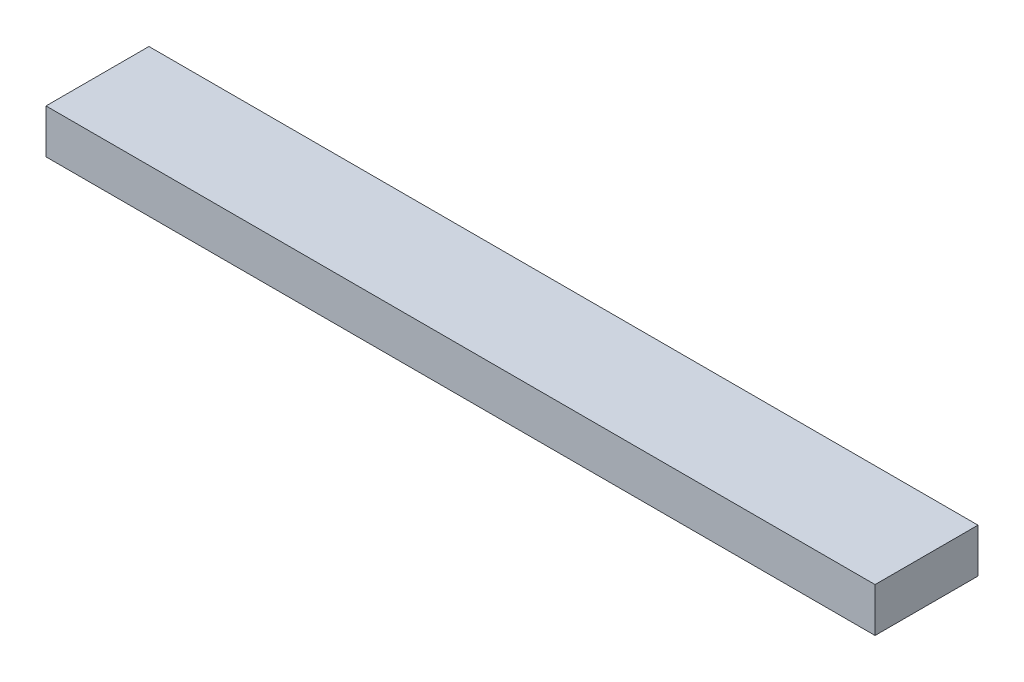
ISO-10303-21;
HEADER;
FILE_DESCRIPTION(('STEP AP214'),'2;1');
FILE_NAME('part.step','',(''),(''),'','','');
FILE_SCHEMA(('AUTOMOTIVE_DESIGN { 1 0 10303 214 1 1 1 1 }'));
ENDSEC;
DATA;
#1=APPLICATION_CONTEXT('core data for automotive mechanical design processes');
#2=APPLICATION_PROTOCOL_DEFINITION('international standard','automotive_design',2000,#1);
#3=PRODUCT_CONTEXT('',#1,'mechanical');
#4=PRODUCT('Part','Part','',(#3));
#5=PRODUCT_RELATED_PRODUCT_CATEGORY('part','',(#4));
#6=PRODUCT_DEFINITION_FORMATION('','',#4);
#7=PRODUCT_DEFINITION_CONTEXT('part definition',#1,'design');
#8=PRODUCT_DEFINITION('design','',#6,#7);
#9=PRODUCT_DEFINITION_SHAPE('','',#8);
#10=(LENGTH_UNIT() NAMED_UNIT(*) SI_UNIT(.MILLI.,.METRE.));
#11=(NAMED_UNIT(*) PLANE_ANGLE_UNIT() SI_UNIT($,.RADIAN.));
#12=(NAMED_UNIT(*) SI_UNIT($,.STERADIAN.) SOLID_ANGLE_UNIT());
#13=UNCERTAINTY_MEASURE_WITH_UNIT(LENGTH_MEASURE(1.E-05),#10,'distance_accuracy_value','');
#14=(GEOMETRIC_REPRESENTATION_CONTEXT(3) GLOBAL_UNCERTAINTY_ASSIGNED_CONTEXT((#13)) GLOBAL_UNIT_ASSIGNED_CONTEXT((#10,
#11,#12)) REPRESENTATION_CONTEXT('',''));
#15=CARTESIAN_POINT('',(0.,0.,0.));
#16=DIRECTION('',(0.,0.,1.));
#17=DIRECTION('',(1.,0.,0.));
#18=AXIS2_PLACEMENT_3D('',#15,#16,#17);
#19=CARTESIAN_POINT('',(0.,38.1,0.));
#20=DIRECTION('',(1.,0.,0.));
#21=DIRECTION('',(0.,0.,-1.));
#22=AXIS2_PLACEMENT_3D('',#19,#20,#21);
#23=PLANE('',#22);
#24=DIRECTION('',(0.,0.,1.));
#25=VECTOR('',#24,1.);
#26=CARTESIAN_POINT('',(0.,0.,0.));
#27=LINE('',#26,#25);
#28=CARTESIAN_POINT('',(0.,0.,-88.9));
#29=VERTEX_POINT('',#28);
#30=CARTESIAN_POINT('',(0.,0.,0.));
#31=VERTEX_POINT('',#30);
#32=EDGE_CURVE('E101',#29,#31,#27,.T.);
#33=ORIENTED_EDGE('',*,*,#32,.T.);
#34=DIRECTION('',(0.,-1.,0.));
#35=VECTOR('',#34,1.);
#36=CARTESIAN_POINT('',(0.,38.1,0.));
#37=LINE('',#36,#35);
#38=CARTESIAN_POINT('',(0.,38.1,0.));
#39=VERTEX_POINT('',#38);
#40=EDGE_CURVE('E11',#39,#31,#37,.T.);
#41=ORIENTED_EDGE('',*,*,#40,.F.);
#42=DIRECTION('',(0.,0.,1.));
#43=VECTOR('',#42,1.);
#44=CARTESIAN_POINT('',(0.,38.1,0.));
#45=LINE('',#44,#43);
#46=CARTESIAN_POINT('',(0.,38.1,-88.9));
#47=VERTEX_POINT('',#46);
#48=EDGE_CURVE('E89',#47,#39,#45,.T.);
#49=ORIENTED_EDGE('',*,*,#48,.F.);
#50=DIRECTION('',(0.,-1.,0.));
#51=VECTOR('',#50,1.);
#52=CARTESIAN_POINT('',(0.,38.1,-88.9));
#53=LINE('',#52,#51);
#54=EDGE_CURVE('E97',#47,#29,#53,.T.);
#55=ORIENTED_EDGE('',*,*,#54,.T.);
#56=EDGE_LOOP('',(#33,#41,#49,#55));
#57=FACE_BOUND('',#56,.T.);
#58=ADVANCED_FACE('F38',(#57),#23,.F.);
#59=CARTESIAN_POINT('',(0.,38.1,0.));
#60=DIRECTION('',(0.,0.,-1.));
#61=DIRECTION('',(-1.,0.,0.));
#62=AXIS2_PLACEMENT_3D('',#59,#60,#61);
#63=PLANE('',#62);
#64=DIRECTION('',(1.,0.,0.));
#65=VECTOR('',#64,1.);
#66=CARTESIAN_POINT('',(0.,0.,0.));
#67=LINE('',#66,#65);
#68=CARTESIAN_POINT('',(715.9625,0.,0.));
#69=VERTEX_POINT('',#68);
#70=EDGE_CURVE('E93',#31,#69,#67,.T.);
#71=ORIENTED_EDGE('',*,*,#70,.T.);
#72=DIRECTION('',(0.,-1.,0.));
#73=VECTOR('',#72,1.);
#74=CARTESIAN_POINT('',(715.9625,38.1,0.));
#75=LINE('',#74,#73);
#76=CARTESIAN_POINT('',(715.9625,38.1,0.));
#77=VERTEX_POINT('',#76);
#78=EDGE_CURVE('E46',#77,#69,#75,.T.);
#79=ORIENTED_EDGE('',*,*,#78,.F.);
#80=DIRECTION('',(1.,0.,0.));
#81=VECTOR('',#80,1.);
#82=CARTESIAN_POINT('',(0.,38.1,0.));
#83=LINE('',#82,#81);
#84=EDGE_CURVE('E84',#39,#77,#83,.T.);
#85=ORIENTED_EDGE('',*,*,#84,.F.);
#86=ORIENTED_EDGE('',*,*,#40,.T.);
#87=EDGE_LOOP('',(#71,#79,#85,#86));
#88=FACE_BOUND('',#87,.T.);
#89=ADVANCED_FACE('F92',(#88),#63,.F.);
#90=CARTESIAN_POINT('',(715.9625,38.1,0.));
#91=DIRECTION('',(-1.,0.,0.));
#92=DIRECTION('',(0.,0.,1.));
#93=AXIS2_PLACEMENT_3D('',#90,#91,#92);
#94=PLANE('',#93);
#95=DIRECTION('',(0.,0.,-1.));
#96=VECTOR('',#95,1.);
#97=CARTESIAN_POINT('',(715.9625,0.,0.));
#98=LINE('',#97,#96);
#99=CARTESIAN_POINT('',(715.9625,0.,-88.9));
#100=VERTEX_POINT('',#99);
#101=EDGE_CURVE('E71',#69,#100,#98,.T.);
#102=ORIENTED_EDGE('',*,*,#101,.T.);
#103=DIRECTION('',(0.,-1.,0.));
#104=VECTOR('',#103,1.);
#105=CARTESIAN_POINT('',(715.9625,38.1,-88.9));
#106=LINE('',#105,#104);
#107=CARTESIAN_POINT('',(715.9625,38.1,-88.9));
#108=VERTEX_POINT('',#107);
#109=EDGE_CURVE('E94',#108,#100,#106,.T.);
#110=ORIENTED_EDGE('',*,*,#109,.F.);
#111=DIRECTION('',(0.,0.,-1.));
#112=VECTOR('',#111,1.);
#113=CARTESIAN_POINT('',(715.9625,38.1,0.));
#114=LINE('',#113,#112);
#115=EDGE_CURVE('E87',#77,#108,#114,.T.);
#116=ORIENTED_EDGE('',*,*,#115,.F.);
#117=ORIENTED_EDGE('',*,*,#78,.T.);
#118=EDGE_LOOP('',(#102,#110,#116,#117));
#119=FACE_BOUND('',#118,.T.);
#120=ADVANCED_FACE('F95',(#119),#94,.F.);
#121=CARTESIAN_POINT('',(0.,38.1,-88.9));
#122=DIRECTION('',(0.,0.,1.));
#123=DIRECTION('',(1.,0.,0.));
#124=AXIS2_PLACEMENT_3D('',#121,#122,#123);
#125=PLANE('',#124);
#126=DIRECTION('',(-1.,0.,0.));
#127=VECTOR('',#126,1.);
#128=CARTESIAN_POINT('',(0.,0.,-88.9));
#129=LINE('',#128,#127);
#130=EDGE_CURVE('E77',#100,#29,#129,.T.);
#131=ORIENTED_EDGE('',*,*,#130,.T.);
#132=ORIENTED_EDGE('',*,*,#54,.F.);
#133=DIRECTION('',(-1.,0.,0.));
#134=VECTOR('',#133,1.);
#135=CARTESIAN_POINT('',(0.,38.1,-88.9));
#136=LINE('',#135,#134);
#137=EDGE_CURVE('E54',#108,#47,#136,.T.);
#138=ORIENTED_EDGE('',*,*,#137,.F.);
#139=ORIENTED_EDGE('',*,*,#109,.T.);
#140=EDGE_LOOP('',(#131,#132,#138,#139));
#141=FACE_BOUND('',#140,.T.);
#142=ADVANCED_FACE('F108',(#141),#125,.F.);
#143=CARTESIAN_POINT('',(0.,38.1,0.));
#144=DIRECTION('',(0.,-1.,0.));
#145=DIRECTION('',(0.,0.,-1.));
#146=AXIS2_PLACEMENT_3D('',#143,#144,#145);
#147=PLANE('',#146);
#148=ORIENTED_EDGE('',*,*,#48,.T.);
#149=ORIENTED_EDGE('',*,*,#84,.T.);
#150=ORIENTED_EDGE('',*,*,#115,.T.);
#151=ORIENTED_EDGE('',*,*,#137,.T.);
#152=EDGE_LOOP('',(#148,#149,#150,#151));
#153=FACE_BOUND('',#152,.T.);
#154=ADVANCED_FACE('F85',(#153),#147,.F.);
#155=CARTESIAN_POINT('',(0.,0.,0.));
#156=DIRECTION('',(0.,-1.,0.));
#157=DIRECTION('',(0.,0.,-1.));
#158=AXIS2_PLACEMENT_3D('',#155,#156,#157);
#159=PLANE('',#158);
#160=ORIENTED_EDGE('',*,*,#32,.F.);
#161=ORIENTED_EDGE('',*,*,#130,.F.);
#162=ORIENTED_EDGE('',*,*,#101,.F.);
#163=ORIENTED_EDGE('',*,*,#70,.F.);
#164=EDGE_LOOP('',(#160,#161,#162,#163));
#165=FACE_BOUND('',#164,.T.);
#166=ADVANCED_FACE('F111',(#165),#159,.T.);
#167=CLOSED_SHELL('',(#58,#89,#120,#142,#154,#166));
#168=MANIFOLD_SOLID_BREP('B2',#167);
#169=ADVANCED_BREP_SHAPE_REPRESENTATION('',(#18,#168),#14);
#170=SHAPE_DEFINITION_REPRESENTATION(#9,#169);
ENDSEC;
END-ISO-10303-21;
